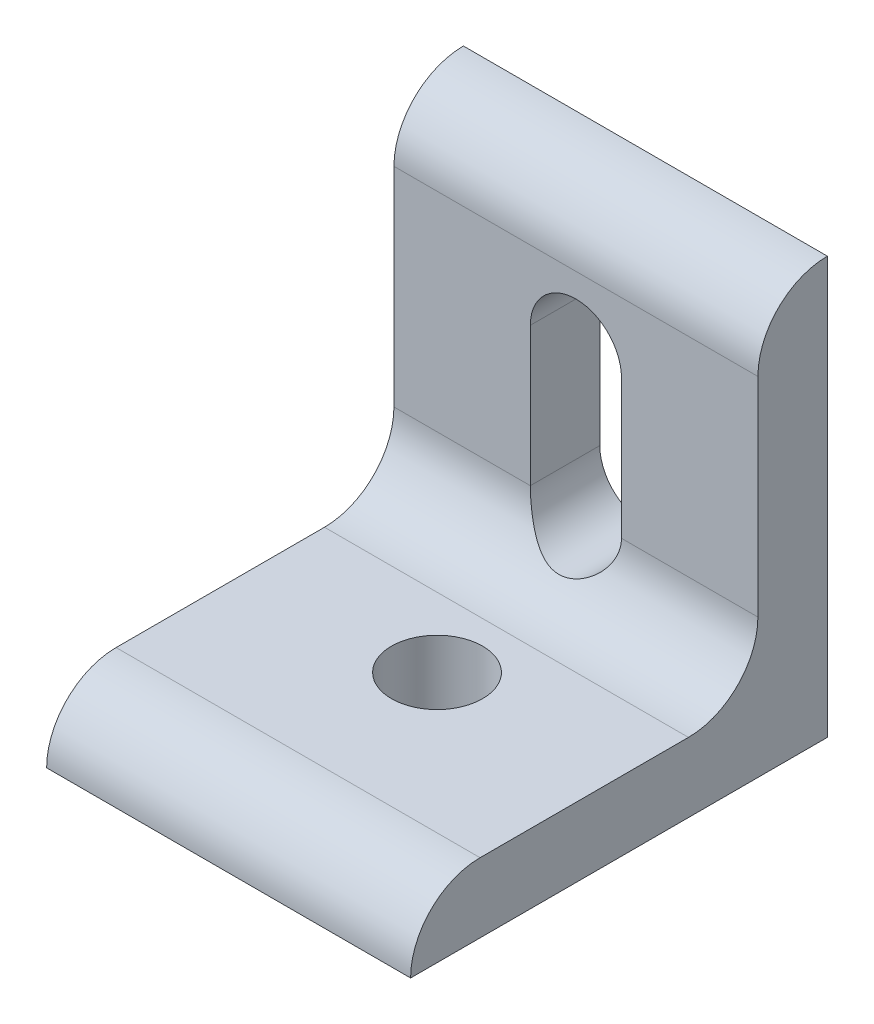
ISO-10303-21;
HEADER;
FILE_DESCRIPTION(('STEP AP214'),'2;1');
FILE_NAME('part.step','',(''),(''),'','','');
FILE_SCHEMA(('AUTOMOTIVE_DESIGN { 1 0 10303 214 1 1 1 1 }'));
ENDSEC;
DATA;
#1=APPLICATION_CONTEXT('core data for automotive mechanical design processes');
#2=APPLICATION_PROTOCOL_DEFINITION('international standard','automotive_design',2000,#1);
#3=PRODUCT_CONTEXT('',#1,'mechanical');
#4=PRODUCT('Part','Part','',(#3));
#5=PRODUCT_RELATED_PRODUCT_CATEGORY('part','',(#4));
#6=PRODUCT_DEFINITION_FORMATION('','',#4);
#7=PRODUCT_DEFINITION_CONTEXT('part definition',#1,'design');
#8=PRODUCT_DEFINITION('design','',#6,#7);
#9=PRODUCT_DEFINITION_SHAPE('','',#8);
#10=(LENGTH_UNIT() NAMED_UNIT(*) SI_UNIT(.MILLI.,.METRE.));
#11=(NAMED_UNIT(*) PLANE_ANGLE_UNIT() SI_UNIT($,.RADIAN.));
#12=(NAMED_UNIT(*) SI_UNIT($,.STERADIAN.) SOLID_ANGLE_UNIT());
#13=UNCERTAINTY_MEASURE_WITH_UNIT(LENGTH_MEASURE(1.E-05),#10,'distance_accuracy_value','');
#14=(GEOMETRIC_REPRESENTATION_CONTEXT(3) GLOBAL_UNCERTAINTY_ASSIGNED_CONTEXT((#13)) GLOBAL_UNIT_ASSIGNED_CONTEXT((#10,
#11,#12)) REPRESENTATION_CONTEXT('',''));
#15=CARTESIAN_POINT('',(0.,0.,0.));
#16=DIRECTION('',(0.,0.,1.));
#17=DIRECTION('',(1.,0.,0.));
#18=AXIS2_PLACEMENT_3D('',#15,#16,#17);
#19=CARTESIAN_POINT('',(-16.637,12.7,12.7));
#20=DIRECTION('',(1.,0.,0.));
#21=DIRECTION('',(0.,0.,-1.));
#22=AXIS2_PLACEMENT_3D('',#19,#20,#21);
#23=CYLINDRICAL_SURFACE('',#22,6.35);
#24=CARTESIAN_POINT('',(-4.1656,12.7,6.35));
#25=CARTESIAN_POINT('',(-4.16562038739308,12.5946203711352,6.34997766017428));
#26=CARTESIAN_POINT('',(-4.16160189610644,12.4892560538155,6.35262253496487));
#27=CARTESIAN_POINT('',(-4.14564517744225,12.2794440548759,6.36307769978686));
#28=CARTESIAN_POINT('',(-4.13371137156387,12.1749958944756,6.37088510601784));
#29=CARTESIAN_POINT('',(-4.10217677599631,11.9684054614918,6.39143472519545));
#30=CARTESIAN_POINT('',(-4.08262249905411,11.8662531027803,6.40414699593807));
#31=CARTESIAN_POINT('',(-4.03613767708446,11.6643548449411,6.43419016196296));
#32=CARTESIAN_POINT('',(-4.00920643992029,11.5646091725746,6.45152149062011));
#33=CARTESIAN_POINT('',(-3.91795463660084,11.2703571178764,6.50981278609476));
#34=CARTESIAN_POINT('',(-3.84308510269966,11.0802557245668,6.55713095473168));
#35=CARTESIAN_POINT('',(-3.66833571692311,10.7159336441004,6.66491563257182));
#36=CARTESIAN_POINT('',(-3.56842413108744,10.5417334924577,6.72539881193613));
#37=CARTESIAN_POINT('',(-3.33739802015174,10.1979246023384,6.86056602997656));
#38=CARTESIAN_POINT('',(-3.20438072553291,10.0298998073763,6.93601241737922));
#39=CARTESIAN_POINT('',(-2.91536692550637,9.7169964177627,7.09154643064273));
#40=CARTESIAN_POINT('',(-2.75934093956008,9.57214802248013,7.17163992968357));
#41=CARTESIAN_POINT('',(-2.4971395097864,9.36360896219138,7.29639812185784));
#42=CARTESIAN_POINT('',(-2.3978378213929,9.29152781671054,7.34170123714309));
#43=CARTESIAN_POINT('',(-2.19265435392656,9.15604274889051,7.43032976761889));
#44=CARTESIAN_POINT('',(-2.08677115460802,9.09264070896246,7.47365475241903));
#45=CARTESIAN_POINT('',(-1.75995012501246,8.91636965381169,7.59830778576379));
#46=CARTESIAN_POINT('',(-1.52930922737758,8.81700992168597,7.67458163478793));
#47=CARTESIAN_POINT('',(-1.11516155505377,8.68231094863351,7.78207880640664));
#48=CARTESIAN_POINT('',(-0.936642352998681,8.63682545566776,7.81993920864664));
#49=CARTESIAN_POINT('',(-0.572303862510036,8.5697640720643,7.87655499804038));
#50=CARTESIAN_POINT('',(-0.386496984350883,8.54814921862218,7.8953415144515));
#51=CARTESIAN_POINT('',(-0.0120250750917063,8.53018784712527,7.91091436508498));
#52=CARTESIAN_POINT('',(0.176647906072433,8.53393373169829,7.90762024827531));
#53=CARTESIAN_POINT('',(0.55021126123903,8.56663440363861,7.87939735045563));
#54=CARTESIAN_POINT('',(0.735098317765199,8.59561040661669,7.85445036194164));
#55=CARTESIAN_POINT('',(1.08918690783512,8.67537234264081,7.78803521822939));
#56=CARTESIAN_POINT('',(1.25871762147244,8.7252860708147,7.7472321074197));
#57=CARTESIAN_POINT('',(1.58719297960886,8.84466371780811,7.65375225711737));
#58=CARTESIAN_POINT('',(1.74613421302282,8.91413389886184,7.60107171539223));
#59=CARTESIAN_POINT('',(2.08271135949404,9.08654056572474,7.47709024504746));
#60=CARTESIAN_POINT('',(2.25774291088749,9.19338968034853,7.40417168121159));
#61=CARTESIAN_POINT('',(2.58941679768652,9.43062800521078,7.25450327085915));
#62=CARTESIAN_POINT('',(2.74603623725387,9.56104602332465,7.17774881979717));
#63=CARTESIAN_POINT('',(3.06879613364744,9.87252299485676,7.01097410985856));
#64=CARTESIAN_POINT('',(3.23048547316671,10.0584904512958,6.92140065624881));
#65=CARTESIAN_POINT('',(3.520511586917,10.4596111153773,6.75439072241382));
#66=CARTESIAN_POINT('',(3.64887610523559,10.6747398166323,6.67694416757663));
#67=CARTESIAN_POINT('',(3.84514497655762,11.085060296209,6.55583920520938));
#68=CARTESIAN_POINT('',(3.91997937980773,11.2758235160936,6.50852979330321));
#69=CARTESIAN_POINT('',(4.01093328411317,11.5707351099613,6.45041308783313));
#70=CARTESIAN_POINT('',(4.0376931017721,11.6704450473073,6.43318780866898));
#71=CARTESIAN_POINT('',(4.08383436786801,11.8722221850614,6.40336063523908));
#72=CARTESIAN_POINT('',(4.10321862952099,11.9742884709133,6.39075697824119));
#73=CARTESIAN_POINT('',(4.13430502068286,12.1798794296784,6.37049694185111));
#74=CARTESIAN_POINT('',(4.14602095520304,12.2834011372083,6.36283167245133));
#75=CARTESIAN_POINT('',(4.16167824592254,12.4912770066665,6.35257244998859));
#76=CARTESIAN_POINT('',(4.16561970156456,12.5956311579299,6.34997843205967));
#77=CARTESIAN_POINT('',(4.1656,12.7,6.35));
#78=B_SPLINE_CURVE_WITH_KNOTS('',3,(#24,#25,#26,#27,#28,#29,#30,#31,#32,#33,#34,#35,#36,#37,#38,
#39,#40,#41,#42,#43,#44,#45,#46,#47,#48,#49,#50,#51,#52,#53,#54,#55,#56,#57,#58,#59,#60,#61,#62,
#63,#64,#65,#66,#67,#68,#69,#70,#71,#72,#73,#74,#75,#76,#77),.UNSPECIFIED.,.F.,.F.,(4,2,2,2,2,2,
2,2,2,2,2,2,2,2,2,2,2,2,2,2,2,2,2,2,2,2,4),(0.,0.316003974951817,0.631831578402327,
0.945760931631138,1.2597197490973,1.88588948681144,2.51285677137031,3.19191454633398,
3.87185006711669,4.26381762540673,4.65587006329431,5.43780665253604,5.99982367703089,
6.5609219882417,7.12406577577411,7.68768355989299,8.22984663996434,8.77218352567043,
9.42281416999402,10.0742455151464,10.8570678317328,11.639236315885,12.2672307349389,
12.5808962966503,12.8944420984869,13.207421871182,13.520397640553),.UNSPECIFIED.);
#79=CARTESIAN_POINT('',(-4.1656,12.7,6.35000000000002));
#80=VERTEX_POINT('',#79);
#81=CARTESIAN_POINT('',(4.1656,12.7,6.35));
#82=VERTEX_POINT('',#81);
#83=EDGE_CURVE('E124',#80,#82,#78,.T.);
#84=ORIENTED_EDGE('',*,*,#83,.F.);
#85=DIRECTION('',(1.,0.,0.));
#86=VECTOR('',#85,1.);
#87=CARTESIAN_POINT('',(-16.637,12.7,6.35));
#88=LINE('',#87,#86);
#89=CARTESIAN_POINT('',(-16.637,12.7,6.35));
#90=VERTEX_POINT('',#89);
#91=EDGE_CURVE('E11',#90,#80,#88,.T.);
#92=ORIENTED_EDGE('',*,*,#91,.F.);
#93=CARTESIAN_POINT('',(-16.637,12.7,12.7));
#94=DIRECTION('',(-1.,0.,0.));
#95=DIRECTION('',(0.,0.,-1.));
#96=AXIS2_PLACEMENT_3D('',#93,#94,#95);
#97=CIRCLE('',#96,6.35);
#98=CARTESIAN_POINT('',(-16.637,6.35,12.7));
#99=VERTEX_POINT('',#98);
#100=EDGE_CURVE('E246',#90,#99,#97,.T.);
#101=ORIENTED_EDGE('',*,*,#100,.T.);
#102=DIRECTION('',(1.,0.,0.));
#103=VECTOR('',#102,1.);
#104=CARTESIAN_POINT('',(-16.637,6.35,12.7));
#105=LINE('',#104,#103);
#106=CARTESIAN_POINT('',(16.637,6.35,12.7));
#107=VERTEX_POINT('',#106);
#108=EDGE_CURVE('E218',#99,#107,#105,.T.);
#109=ORIENTED_EDGE('',*,*,#108,.T.);
#110=CARTESIAN_POINT('',(16.637,12.7,12.7));
#111=DIRECTION('',(-1.,0.,0.));
#112=DIRECTION('',(0.,0.,-1.));
#113=AXIS2_PLACEMENT_3D('',#110,#111,#112);
#114=CIRCLE('',#113,6.35);
#115=CARTESIAN_POINT('',(16.637,12.7,6.35));
#116=VERTEX_POINT('',#115);
#117=EDGE_CURVE('E226',#116,#107,#114,.T.);
#118=ORIENTED_EDGE('',*,*,#117,.F.);
#119=EDGE_CURVE('E42',#82,#116,#88,.T.);
#120=ORIENTED_EDGE('',*,*,#119,.F.);
#121=EDGE_LOOP('',(#84,#92,#101,#109,#118,#120));
#122=FACE_BOUND('',#121,.T.);
#123=ADVANCED_FACE('F33',(#122),#23,.F.);
#124=CARTESIAN_POINT('',(-16.637,12.7,6.35));
#125=DIRECTION('',(0.,0.,1.));
#126=DIRECTION('',(0.,-1.,0.));
#127=AXIS2_PLACEMENT_3D('',#124,#125,#126);
#128=PLANE('',#127);
#129=DIRECTION('',(0.,-1.,0.));
#130=VECTOR('',#129,1.);
#131=CARTESIAN_POINT('',(-4.1656,12.7,6.35));
#132=LINE('',#131,#130);
#133=CARTESIAN_POINT('',(-4.1656,25.4,6.35000000000002));
#134=VERTEX_POINT('',#133);
#135=EDGE_CURVE('E153',#134,#80,#132,.T.);
#136=ORIENTED_EDGE('',*,*,#135,.F.);
#137=CARTESIAN_POINT('',(0.,25.4,6.35));
#138=DIRECTION('',(0.,0.,1.));
#139=DIRECTION('',(0.,-1.,0.));
#140=AXIS2_PLACEMENT_3D('',#137,#138,#139);
#141=CIRCLE('',#140,4.1656);
#142=CARTESIAN_POINT('',(4.1656,25.4,6.35000000000002));
#143=VERTEX_POINT('',#142);
#144=EDGE_CURVE('E277',#143,#134,#141,.T.);
#145=ORIENTED_EDGE('',*,*,#144,.F.);
#146=DIRECTION('',(0.,1.,0.));
#147=VECTOR('',#146,1.);
#148=CARTESIAN_POINT('',(4.1656,12.7,6.35));
#149=LINE('',#148,#147);
#150=EDGE_CURVE('E144',#82,#143,#149,.T.);
#151=ORIENTED_EDGE('',*,*,#150,.F.);
#152=ORIENTED_EDGE('',*,*,#119,.T.);
#153=DIRECTION('',(0.,-1.,0.));
#154=VECTOR('',#153,1.);
#155=CARTESIAN_POINT('',(16.637,12.7,6.35));
#156=LINE('',#155,#154);
#157=CARTESIAN_POINT('',(16.637,31.75,6.35000000000001));
#158=VERTEX_POINT('',#157);
#159=EDGE_CURVE('E244',#158,#116,#156,.T.);
#160=ORIENTED_EDGE('',*,*,#159,.F.);
#161=DIRECTION('',(1.,0.,0.));
#162=VECTOR('',#161,1.);
#163=CARTESIAN_POINT('',(-16.637,31.75,6.35000000000001));
#164=LINE('',#163,#162);
#165=CARTESIAN_POINT('',(-16.637,31.75,6.35000000000001));
#166=VERTEX_POINT('',#165);
#167=EDGE_CURVE('E215',#166,#158,#164,.T.);
#168=ORIENTED_EDGE('',*,*,#167,.F.);
#169=DIRECTION('',(0.,-1.,0.));
#170=VECTOR('',#169,1.);
#171=CARTESIAN_POINT('',(-16.637,12.7,6.35));
#172=LINE('',#171,#170);
#173=EDGE_CURVE('E213',#166,#90,#172,.T.);
#174=ORIENTED_EDGE('',*,*,#173,.T.);
#175=ORIENTED_EDGE('',*,*,#91,.T.);
#176=EDGE_LOOP('',(#136,#145,#151,#152,#160,#168,#174,#175));
#177=FACE_BOUND('',#176,.T.);
#178=ADVANCED_FACE('F178',(#177),#128,.T.);
#179=CARTESIAN_POINT('',(-16.637,31.75,0.));
#180=DIRECTION('',(1.,0.,0.));
#181=DIRECTION('',(0.,0.,-1.));
#182=AXIS2_PLACEMENT_3D('',#179,#180,#181);
#183=CYLINDRICAL_SURFACE('',#182,6.35);
#184=CARTESIAN_POINT('',(16.637,31.75,0.));
#185=DIRECTION('',(1.,0.,0.));
#186=DIRECTION('',(0.,0.,-1.));
#187=AXIS2_PLACEMENT_3D('',#184,#185,#186);
#188=CIRCLE('',#187,6.35);
#189=CARTESIAN_POINT('',(16.637,38.1,0.));
#190=VERTEX_POINT('',#189);
#191=EDGE_CURVE('E241',#190,#158,#188,.T.);
#192=ORIENTED_EDGE('',*,*,#191,.F.);
#193=DIRECTION('',(1.,0.,0.));
#194=VECTOR('',#193,1.);
#195=CARTESIAN_POINT('',(-16.637,38.1,0.));
#196=LINE('',#195,#194);
#197=CARTESIAN_POINT('',(-16.637,38.1,0.));
#198=VERTEX_POINT('',#197);
#199=EDGE_CURVE('E249',#198,#190,#196,.T.);
#200=ORIENTED_EDGE('',*,*,#199,.F.);
#201=CARTESIAN_POINT('',(-16.637,31.75,0.));
#202=DIRECTION('',(1.,0.,0.));
#203=DIRECTION('',(0.,0.,-1.));
#204=AXIS2_PLACEMENT_3D('',#201,#202,#203);
#205=CIRCLE('',#204,6.35);
#206=EDGE_CURVE('E219',#198,#166,#205,.T.);
#207=ORIENTED_EDGE('',*,*,#206,.T.);
#208=ORIENTED_EDGE('',*,*,#167,.T.);
#209=EDGE_LOOP('',(#192,#200,#207,#208));
#210=FACE_BOUND('',#209,.T.);
#211=ADVANCED_FACE('F181',(#210),#183,.T.);
#212=CARTESIAN_POINT('',(-16.637,0.,0.));
#213=DIRECTION('',(0.,0.,-1.));
#214=DIRECTION('',(0.,1.,0.));
#215=AXIS2_PLACEMENT_3D('',#212,#213,#214);
#216=PLANE('',#215);
#217=CARTESIAN_POINT('',(0.,25.4,0.));
#218=DIRECTION('',(0.,0.,-1.));
#219=DIRECTION('',(0.,1.,0.));
#220=AXIS2_PLACEMENT_3D('',#217,#218,#219);
#221=CIRCLE('',#220,4.1656);
#222=CARTESIAN_POINT('',(-4.1656,25.4,0.));
#223=VERTEX_POINT('',#222);
#224=CARTESIAN_POINT('',(4.1656,25.4,0.));
#225=VERTEX_POINT('',#224);
#226=EDGE_CURVE('E58',#223,#225,#221,.T.);
#227=ORIENTED_EDGE('',*,*,#226,.F.);
#228=DIRECTION('',(0.,1.,0.));
#229=VECTOR('',#228,1.);
#230=CARTESIAN_POINT('',(-4.1656,25.4,0.));
#231=LINE('',#230,#229);
#232=CARTESIAN_POINT('',(-4.1656,12.7,0.));
#233=VERTEX_POINT('',#232);
#234=EDGE_CURVE('E137',#233,#223,#231,.T.);
#235=ORIENTED_EDGE('',*,*,#234,.F.);
#236=CARTESIAN_POINT('',(0.,12.7,0.));
#237=DIRECTION('',(0.,0.,-1.));
#238=DIRECTION('',(0.,1.,0.));
#239=AXIS2_PLACEMENT_3D('',#236,#237,#238);
#240=CIRCLE('',#239,4.1656);
#241=CARTESIAN_POINT('',(4.1656,12.7,0.));
#242=VERTEX_POINT('',#241);
#243=EDGE_CURVE('E121',#242,#233,#240,.T.);
#244=ORIENTED_EDGE('',*,*,#243,.F.);
#245=DIRECTION('',(0.,-1.,0.));
#246=VECTOR('',#245,1.);
#247=CARTESIAN_POINT('',(4.1656,12.7,0.));
#248=LINE('',#247,#246);
#249=EDGE_CURVE('E130',#225,#242,#248,.T.);
#250=ORIENTED_EDGE('',*,*,#249,.F.);
#251=EDGE_LOOP('',(#227,#235,#244,#250));
#252=FACE_BOUND('',#251,.T.);
#253=DIRECTION('',(0.,1.,0.));
#254=VECTOR('',#253,1.);
#255=CARTESIAN_POINT('',(16.637,0.,0.));
#256=LINE('',#255,#254);
#257=CARTESIAN_POINT('',(16.637,0.,0.));
#258=VERTEX_POINT('',#257);
#259=EDGE_CURVE('E238',#258,#190,#256,.T.);
#260=ORIENTED_EDGE('',*,*,#259,.F.);
#261=DIRECTION('',(1.,0.,0.));
#262=VECTOR('',#261,1.);
#263=CARTESIAN_POINT('',(-16.637,0.,0.));
#264=LINE('',#263,#262);
#265=CARTESIAN_POINT('',(-16.637,0.,0.));
#266=VERTEX_POINT('',#265);
#267=EDGE_CURVE('E251',#266,#258,#264,.T.);
#268=ORIENTED_EDGE('',*,*,#267,.F.);
#269=DIRECTION('',(0.,1.,0.));
#270=VECTOR('',#269,1.);
#271=CARTESIAN_POINT('',(-16.637,0.,0.));
#272=LINE('',#271,#270);
#273=EDGE_CURVE('E222',#266,#198,#272,.T.);
#274=ORIENTED_EDGE('',*,*,#273,.T.);
#275=ORIENTED_EDGE('',*,*,#199,.T.);
#276=EDGE_LOOP('',(#260,#268,#274,#275));
#277=FACE_BOUND('',#276,.T.);
#278=ADVANCED_FACE('F134',(#252,#277),#216,.T.);
#279=CARTESIAN_POINT('',(-16.637,0.,38.1));
#280=DIRECTION('',(0.,-1.,0.));
#281=DIRECTION('',(0.,0.,-1.));
#282=AXIS2_PLACEMENT_3D('',#279,#280,#281);
#283=PLANE('',#282);
#284=CARTESIAN_POINT('',(0.,0.,19.05));
#285=DIRECTION('',(0.,-1.,0.));
#286=DIRECTION('',(0.,0.,-1.));
#287=AXIS2_PLACEMENT_3D('',#284,#285,#286);
#288=CIRCLE('',#287,4.1656);
#289=CARTESIAN_POINT('',(0.,0.,14.8844));
#290=VERTEX_POINT('',#289);
#291=EDGE_CURVE('E279',#290,#290,#288,.T.);
#292=ORIENTED_EDGE('',*,*,#291,.F.);
#293=EDGE_LOOP('',(#292));
#294=FACE_BOUND('',#293,.T.);
#295=DIRECTION('',(0.,0.,-1.));
#296=VECTOR('',#295,1.);
#297=CARTESIAN_POINT('',(16.637,0.,38.1));
#298=LINE('',#297,#296);
#299=CARTESIAN_POINT('',(16.637,0.,38.1));
#300=VERTEX_POINT('',#299);
#301=EDGE_CURVE('E235',#300,#258,#298,.T.);
#302=ORIENTED_EDGE('',*,*,#301,.F.);
#303=DIRECTION('',(1.,0.,0.));
#304=VECTOR('',#303,1.);
#305=CARTESIAN_POINT('',(-16.637,0.,38.1));
#306=LINE('',#305,#304);
#307=CARTESIAN_POINT('',(-16.637,0.,38.1));
#308=VERTEX_POINT('',#307);
#309=EDGE_CURVE('E253',#308,#300,#306,.T.);
#310=ORIENTED_EDGE('',*,*,#309,.F.);
#311=DIRECTION('',(0.,0.,-1.));
#312=VECTOR('',#311,1.);
#313=CARTESIAN_POINT('',(-16.637,0.,38.1));
#314=LINE('',#313,#312);
#315=EDGE_CURVE('E266',#308,#266,#314,.T.);
#316=ORIENTED_EDGE('',*,*,#315,.T.);
#317=ORIENTED_EDGE('',*,*,#267,.T.);
#318=EDGE_LOOP('',(#302,#310,#316,#317));
#319=FACE_BOUND('',#318,.T.);
#320=ADVANCED_FACE('F188',(#294,#319),#283,.T.);
#321=CARTESIAN_POINT('',(-16.637,0.,31.75));
#322=DIRECTION('',(1.,0.,0.));
#323=DIRECTION('',(0.,0.,-1.));
#324=AXIS2_PLACEMENT_3D('',#321,#322,#323);
#325=CYLINDRICAL_SURFACE('',#324,6.35);
#326=CARTESIAN_POINT('',(16.637,0.,31.75));
#327=DIRECTION('',(1.,0.,0.));
#328=DIRECTION('',(0.,0.,-1.));
#329=AXIS2_PLACEMENT_3D('',#326,#327,#328);
#330=CIRCLE('',#329,6.35);
#331=CARTESIAN_POINT('',(16.637,6.35,31.75));
#332=VERTEX_POINT('',#331);
#333=EDGE_CURVE('E232',#332,#300,#330,.T.);
#334=ORIENTED_EDGE('',*,*,#333,.F.);
#335=DIRECTION('',(1.,0.,0.));
#336=VECTOR('',#335,1.);
#337=CARTESIAN_POINT('',(-16.637,6.35,31.75));
#338=LINE('',#337,#336);
#339=CARTESIAN_POINT('',(-16.637,6.35,31.75));
#340=VERTEX_POINT('',#339);
#341=EDGE_CURVE('E221',#340,#332,#338,.T.);
#342=ORIENTED_EDGE('',*,*,#341,.F.);
#343=CARTESIAN_POINT('',(-16.637,0.,31.75));
#344=DIRECTION('',(1.,0.,0.));
#345=DIRECTION('',(0.,0.,-1.));
#346=AXIS2_PLACEMENT_3D('',#343,#344,#345);
#347=CIRCLE('',#346,6.35);
#348=EDGE_CURVE('E264',#340,#308,#347,.T.);
#349=ORIENTED_EDGE('',*,*,#348,.T.);
#350=ORIENTED_EDGE('',*,*,#309,.T.);
#351=EDGE_LOOP('',(#334,#342,#349,#350));
#352=FACE_BOUND('',#351,.T.);
#353=ADVANCED_FACE('F191',(#352),#325,.T.);
#354=CARTESIAN_POINT('',(-16.637,6.35,31.75));
#355=DIRECTION('',(0.,1.,0.));
#356=DIRECTION('',(0.,0.,1.));
#357=AXIS2_PLACEMENT_3D('',#354,#355,#356);
#358=PLANE('',#357);
#359=CARTESIAN_POINT('',(0.,6.35,19.05));
#360=DIRECTION('',(0.,1.,0.));
#361=DIRECTION('',(0.,0.,1.));
#362=AXIS2_PLACEMENT_3D('',#359,#360,#361);
#363=CIRCLE('',#362,4.1656);
#364=CARTESIAN_POINT('',(0.,6.34999999999999,14.8844));
#365=VERTEX_POINT('',#364);
#366=EDGE_CURVE('E37',#365,#365,#363,.T.);
#367=ORIENTED_EDGE('',*,*,#366,.F.);
#368=EDGE_LOOP('',(#367));
#369=FACE_BOUND('',#368,.T.);
#370=DIRECTION('',(0.,0.,1.));
#371=VECTOR('',#370,1.);
#372=CARTESIAN_POINT('',(16.637,6.35,31.75));
#373=LINE('',#372,#371);
#374=EDGE_CURVE('E229',#107,#332,#373,.T.);
#375=ORIENTED_EDGE('',*,*,#374,.F.);
#376=ORIENTED_EDGE('',*,*,#108,.F.);
#377=DIRECTION('',(0.,0.,1.));
#378=VECTOR('',#377,1.);
#379=CARTESIAN_POINT('',(-16.637,6.35,31.75));
#380=LINE('',#379,#378);
#381=EDGE_CURVE('E259',#99,#340,#380,.T.);
#382=ORIENTED_EDGE('',*,*,#381,.T.);
#383=ORIENTED_EDGE('',*,*,#341,.T.);
#384=EDGE_LOOP('',(#375,#376,#382,#383));
#385=FACE_BOUND('',#384,.T.);
#386=ADVANCED_FACE('F173',(#369,#385),#358,.T.);
#387=CARTESIAN_POINT('',(-16.637,12.7,12.7));
#388=DIRECTION('',(1.,0.,0.));
#389=DIRECTION('',(0.,0.,-1.));
#390=AXIS2_PLACEMENT_3D('',#387,#388,#389);
#391=PLANE('',#390);
#392=ORIENTED_EDGE('',*,*,#100,.F.);
#393=ORIENTED_EDGE('',*,*,#173,.F.);
#394=ORIENTED_EDGE('',*,*,#206,.F.);
#395=ORIENTED_EDGE('',*,*,#273,.F.);
#396=ORIENTED_EDGE('',*,*,#315,.F.);
#397=ORIENTED_EDGE('',*,*,#348,.F.);
#398=ORIENTED_EDGE('',*,*,#381,.F.);
#399=EDGE_LOOP('',(#392,#393,#394,#395,#396,#397,#398));
#400=FACE_BOUND('',#399,.T.);
#401=ADVANCED_FACE('F170',(#400),#391,.F.);
#402=CARTESIAN_POINT('',(16.637,12.7,12.7));
#403=DIRECTION('',(1.,0.,0.));
#404=DIRECTION('',(0.,0.,-1.));
#405=AXIS2_PLACEMENT_3D('',#402,#403,#404);
#406=PLANE('',#405);
#407=ORIENTED_EDGE('',*,*,#117,.T.);
#408=ORIENTED_EDGE('',*,*,#374,.T.);
#409=ORIENTED_EDGE('',*,*,#333,.T.);
#410=ORIENTED_EDGE('',*,*,#301,.T.);
#411=ORIENTED_EDGE('',*,*,#259,.T.);
#412=ORIENTED_EDGE('',*,*,#191,.T.);
#413=ORIENTED_EDGE('',*,*,#159,.T.);
#414=EDGE_LOOP('',(#407,#408,#409,#410,#411,#412,#413));
#415=FACE_BOUND('',#414,.T.);
#416=ADVANCED_FACE('F168',(#415),#406,.T.);
#417=CARTESIAN_POINT('',(0.,38.1,19.05));
#418=DIRECTION('',(0.,-1.,0.));
#419=DIRECTION('',(0.,0.,-1.));
#420=AXIS2_PLACEMENT_3D('',#417,#418,#419);
#421=CYLINDRICAL_SURFACE('',#420,4.1656);
#422=CARTESIAN_POINT('',(0.,6.34999999999999,14.8844));
#423=CARTESIAN_POINT('',(0.,6.28385416666666,14.8844));
#424=CARTESIAN_POINT('',(0.,6.21770833333333,14.8844));
#425=CARTESIAN_POINT('',(0.,6.08541666666666,14.8844));
#426=CARTESIAN_POINT('',(0.,6.01927083333333,14.8844));
#427=CARTESIAN_POINT('',(0.,5.88697916666666,14.8844));
#428=CARTESIAN_POINT('',(0.,5.82083333333333,14.8844));
#429=CARTESIAN_POINT('',(0.,5.68854166666666,14.8844));
#430=CARTESIAN_POINT('',(0.,5.62239583333333,14.8844));
#431=CARTESIAN_POINT('',(0.,5.49010416666667,14.8844));
#432=CARTESIAN_POINT('',(0.,5.42395833333333,14.8844));
#433=CARTESIAN_POINT('',(0.,5.29166666666666,14.8844));
#434=CARTESIAN_POINT('',(0.,5.22552083333333,14.8844));
#435=CARTESIAN_POINT('',(0.,5.09322916666666,14.8844));
#436=CARTESIAN_POINT('',(0.,5.02708333333333,14.8844));
#437=CARTESIAN_POINT('',(0.,4.89479166666666,14.8844));
#438=CARTESIAN_POINT('',(0.,4.82864583333333,14.8844));
#439=CARTESIAN_POINT('',(0.,4.69635416666666,14.8844));
#440=CARTESIAN_POINT('',(0.,4.63020833333333,14.8844));
#441=CARTESIAN_POINT('',(0.,4.49791666666666,14.8844));
#442=CARTESIAN_POINT('',(0.,4.43177083333333,14.8844));
#443=CARTESIAN_POINT('',(0.,4.29947916666666,14.8844));
#444=CARTESIAN_POINT('',(0.,4.23333333333333,14.8844));
#445=CARTESIAN_POINT('',(0.,4.10104166666666,14.8844));
#446=CARTESIAN_POINT('',(0.,4.03489583333333,14.8844));
#447=CARTESIAN_POINT('',(0.,3.90260416666666,14.8844));
#448=CARTESIAN_POINT('',(0.,3.83645833333333,14.8844));
#449=CARTESIAN_POINT('',(0.,3.70416666666666,14.8844));
#450=CARTESIAN_POINT('',(0.,3.63802083333333,14.8844));
#451=CARTESIAN_POINT('',(0.,3.50572916666666,14.8844));
#452=CARTESIAN_POINT('',(0.,3.43958333333333,14.8844));
#453=CARTESIAN_POINT('',(0.,3.30729166666667,14.8844));
#454=CARTESIAN_POINT('',(0.,3.24114583333333,14.8844));
#455=CARTESIAN_POINT('',(0.,3.10885416666666,14.8844));
#456=CARTESIAN_POINT('',(0.,3.04270833333333,14.8844));
#457=CARTESIAN_POINT('',(0.,2.91041666666666,14.8844));
#458=CARTESIAN_POINT('',(0.,2.84427083333333,14.8844));
#459=CARTESIAN_POINT('',(0.,2.71197916666667,14.8844));
#460=CARTESIAN_POINT('',(0.,2.64583333333333,14.8844));
#461=CARTESIAN_POINT('',(0.,2.51354166666667,14.8844));
#462=CARTESIAN_POINT('',(0.,2.44739583333333,14.8844));
#463=CARTESIAN_POINT('',(0.,2.31510416666667,14.8844));
#464=CARTESIAN_POINT('',(0.,2.24895833333333,14.8844));
#465=CARTESIAN_POINT('',(0.,2.11666666666666,14.8844));
#466=CARTESIAN_POINT('',(0.,2.05052083333333,14.8844));
#467=CARTESIAN_POINT('',(0.,1.91822916666666,14.8844));
#468=CARTESIAN_POINT('',(0.,1.85208333333333,14.8844));
#469=CARTESIAN_POINT('',(0.,1.71979166666667,14.8844));
#470=CARTESIAN_POINT('',(0.,1.65364583333333,14.8844));
#471=CARTESIAN_POINT('',(0.,1.52135416666666,14.8844));
#472=CARTESIAN_POINT('',(0.,1.45520833333333,14.8844));
#473=CARTESIAN_POINT('',(0.,1.32291666666666,14.8844));
#474=CARTESIAN_POINT('',(0.,1.25677083333333,14.8844));
#475=CARTESIAN_POINT('',(0.,1.12447916666667,14.8844));
#476=CARTESIAN_POINT('',(0.,1.05833333333333,14.8844));
#477=CARTESIAN_POINT('',(0.,0.926041666666664,14.8844));
#478=CARTESIAN_POINT('',(0.,0.85989583333333,14.8844));
#479=CARTESIAN_POINT('',(0.,0.727604166666664,14.8844));
#480=CARTESIAN_POINT('',(0.,0.661458333333332,14.8844));
#481=CARTESIAN_POINT('',(0.,0.529166666666666,14.8844));
#482=CARTESIAN_POINT('',(0.,0.463020833333332,14.8844));
#483=CARTESIAN_POINT('',(0.,0.330729166666666,14.8844));
#484=CARTESIAN_POINT('',(0.,0.264583333333334,14.8844));
#485=CARTESIAN_POINT('',(0.,0.132291666666668,14.8844));
#486=CARTESIAN_POINT('',(0.,0.0661458333333342,14.8844));
#487=CARTESIAN_POINT('',(0.,0.,14.8844));
#488=B_SPLINE_CURVE_WITH_KNOTS('',3,(#422,#423,#424,#425,#426,#427,#428,#429,#430,#431,#432,
#433,#434,#435,#436,#437,#438,#439,#440,#441,#442,#443,#444,#445,#446,#447,#448,#449,#450,#451,
#452,#453,#454,#455,#456,#457,#458,#459,#460,#461,#462,#463,#464,#465,#466,#467,#468,#469,#470,
#471,#472,#473,#474,#475,#476,#477,#478,#479,#480,#481,#482,#483,#484,#485,#486,#487),
.UNSPECIFIED.,.F.,.F.,(4,2,2,2,2,2,2,2,2,2,2,2,2,2,2,2,2,2,2,2,2,2,2,2,2,2,2,2,2,2,2,2,4),(0.,
0.198437500000002,0.396874999999998,0.5953125,0.793749999999996,0.992187499999998,1.190625,
1.3890625,1.5875,1.7859375,1.984375,2.1828125,2.38125,2.5796875,2.778125,2.97656249999999,3.175,
3.3734375,3.571875,3.7703125,3.96874999999999,4.1671875,4.365625,4.56406249999999,4.7625,
4.9609375,5.15937499999999,5.3578125,5.55625,5.75468749999999,5.953125,6.15156249999999,
6.34999999999999),.UNSPECIFIED.);
#489=EDGE_CURVE('BSEAM165',#365,#290,#488,.T.);
#490=ORIENTED_EDGE('',*,*,#366,.T.);
#491=ORIENTED_EDGE('',*,*,#291,.T.);
#492=ORIENTED_EDGE('',*,*,#489,.T.);
#493=ORIENTED_EDGE('',*,*,#489,.F.);
#494=EDGE_LOOP('',(#490,#492,#491,#493));
#495=FACE_BOUND('',#494,.T.);
#496=ADVANCED_FACE('F165',(#495),#421,.F.);
#497=CARTESIAN_POINT('',(0.,25.4,38.1));
#498=DIRECTION('',(0.,0.,-1.));
#499=DIRECTION('',(0.,1.,0.));
#500=AXIS2_PLACEMENT_3D('',#497,#498,#499);
#501=CYLINDRICAL_SURFACE('',#500,4.1656);
#502=ORIENTED_EDGE('',*,*,#144,.T.);
#503=DIRECTION('',(0.,0.,-1.));
#504=VECTOR('',#503,1.);
#505=CARTESIAN_POINT('',(-4.1656,25.4,38.1));
#506=LINE('',#505,#504);
#507=EDGE_CURVE('E142',#134,#223,#506,.T.);
#508=ORIENTED_EDGE('',*,*,#507,.T.);
#509=ORIENTED_EDGE('',*,*,#226,.T.);
#510=DIRECTION('',(0.,0.,-1.));
#511=VECTOR('',#510,1.);
#512=CARTESIAN_POINT('',(4.1656,25.4,38.1));
#513=LINE('',#512,#511);
#514=EDGE_CURVE('E127',#143,#225,#513,.T.);
#515=ORIENTED_EDGE('',*,*,#514,.F.);
#516=EDGE_LOOP('',(#502,#508,#509,#515));
#517=FACE_BOUND('',#516,.T.);
#518=ADVANCED_FACE('F162',(#517),#501,.F.);
#519=CARTESIAN_POINT('',(-4.1656,25.4,38.1));
#520=DIRECTION('',(-1.,0.,0.));
#521=DIRECTION('',(0.,0.,1.));
#522=AXIS2_PLACEMENT_3D('',#519,#520,#521);
#523=PLANE('',#522);
#524=ORIENTED_EDGE('',*,*,#135,.T.);
#525=DIRECTION('',(0.,0.,-1.));
#526=VECTOR('',#525,1.);
#527=CARTESIAN_POINT('',(-4.1656,12.7,38.1));
#528=LINE('',#527,#526);
#529=EDGE_CURVE('E126',#80,#233,#528,.T.);
#530=ORIENTED_EDGE('',*,*,#529,.T.);
#531=ORIENTED_EDGE('',*,*,#234,.T.);
#532=ORIENTED_EDGE('',*,*,#507,.F.);
#533=EDGE_LOOP('',(#524,#530,#531,#532));
#534=FACE_BOUND('',#533,.T.);
#535=ADVANCED_FACE('F159',(#534),#523,.F.);
#536=CARTESIAN_POINT('',(0.,12.7,38.1));
#537=DIRECTION('',(0.,0.,-1.));
#538=DIRECTION('',(0.,1.,0.));
#539=AXIS2_PLACEMENT_3D('',#536,#537,#538);
#540=CYLINDRICAL_SURFACE('',#539,4.1656);
#541=ORIENTED_EDGE('',*,*,#83,.T.);
#542=DIRECTION('',(0.,0.,-1.));
#543=VECTOR('',#542,1.);
#544=CARTESIAN_POINT('',(4.1656,12.7,38.1));
#545=LINE('',#544,#543);
#546=EDGE_CURVE('E50',#82,#242,#545,.T.);
#547=ORIENTED_EDGE('',*,*,#546,.T.);
#548=ORIENTED_EDGE('',*,*,#243,.T.);
#549=ORIENTED_EDGE('',*,*,#529,.F.);
#550=EDGE_LOOP('',(#541,#547,#548,#549));
#551=FACE_BOUND('',#550,.T.);
#552=ADVANCED_FACE('F118',(#551),#540,.F.);
#553=CARTESIAN_POINT('',(4.1656,12.7,38.1));
#554=DIRECTION('',(1.,0.,0.));
#555=DIRECTION('',(0.,0.,-1.));
#556=AXIS2_PLACEMENT_3D('',#553,#554,#555);
#557=PLANE('',#556);
#558=ORIENTED_EDGE('',*,*,#150,.T.);
#559=ORIENTED_EDGE('',*,*,#514,.T.);
#560=ORIENTED_EDGE('',*,*,#249,.T.);
#561=ORIENTED_EDGE('',*,*,#546,.F.);
#562=EDGE_LOOP('',(#558,#559,#560,#561));
#563=FACE_BOUND('',#562,.T.);
#564=ADVANCED_FACE('F131',(#563),#557,.F.);
#565=CLOSED_SHELL('',(#123,#178,#211,#278,#320,#353,#386,#401,#416,#496,#518,#535,#552,#564));
#566=MANIFOLD_SOLID_BREP('B2',#565);
#567=ADVANCED_BREP_SHAPE_REPRESENTATION('',(#18,#566),#14);
#568=SHAPE_DEFINITION_REPRESENTATION(#9,#567);
ENDSEC;
END-ISO-10303-21;
